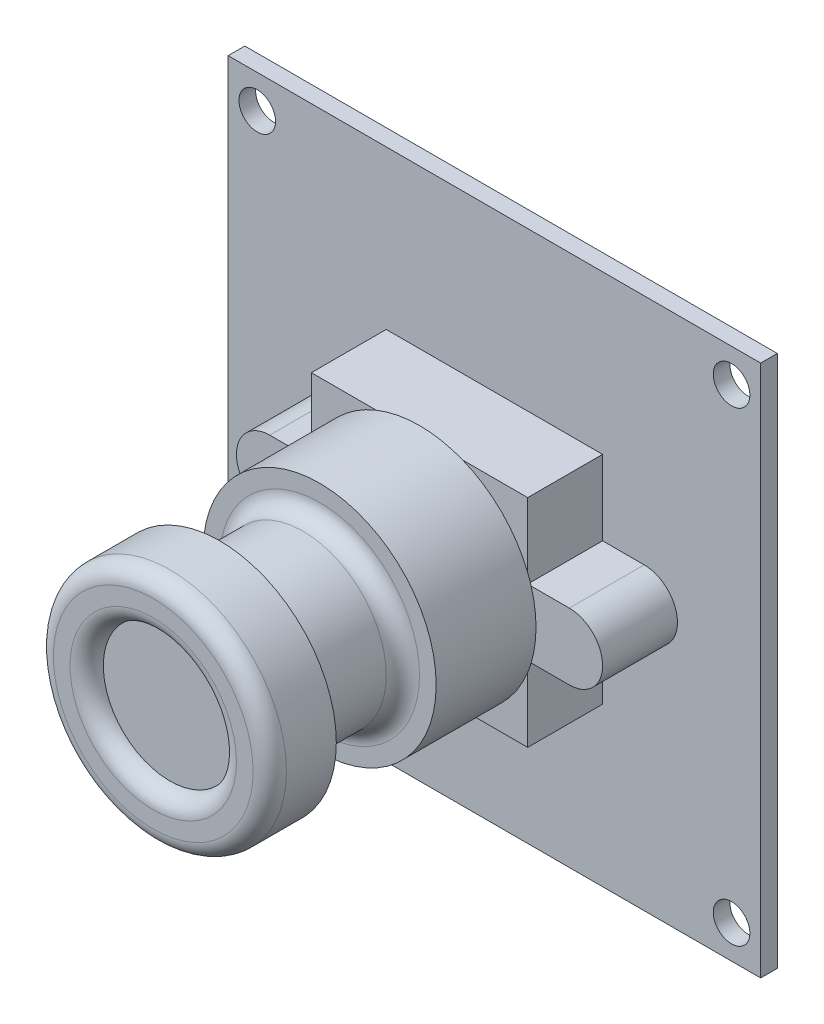
ISO-10303-21;
HEADER;
FILE_DESCRIPTION(('STEP AP214'),'2;1');
FILE_NAME('part.step','',(''),(''),'','','');
FILE_SCHEMA(('AUTOMOTIVE_DESIGN { 1 0 10303 214 1 1 1 1 }'));
ENDSEC;
DATA;
#1=APPLICATION_CONTEXT('core data for automotive mechanical design processes');
#2=APPLICATION_PROTOCOL_DEFINITION('international standard','automotive_design',2000,#1);
#3=PRODUCT_CONTEXT('',#1,'mechanical');
#4=PRODUCT('Part','Part','',(#3));
#5=PRODUCT_RELATED_PRODUCT_CATEGORY('part','',(#4));
#6=PRODUCT_DEFINITION_FORMATION('','',#4);
#7=PRODUCT_DEFINITION_CONTEXT('part definition',#1,'design');
#8=PRODUCT_DEFINITION('design','',#6,#7);
#9=PRODUCT_DEFINITION_SHAPE('','',#8);
#10=(LENGTH_UNIT() NAMED_UNIT(*) SI_UNIT(.MILLI.,.METRE.));
#11=(NAMED_UNIT(*) PLANE_ANGLE_UNIT() SI_UNIT($,.RADIAN.));
#12=(NAMED_UNIT(*) SI_UNIT($,.STERADIAN.) SOLID_ANGLE_UNIT());
#13=UNCERTAINTY_MEASURE_WITH_UNIT(LENGTH_MEASURE(1.E-05),#10,'distance_accuracy_value','');
#14=(GEOMETRIC_REPRESENTATION_CONTEXT(3) GLOBAL_UNCERTAINTY_ASSIGNED_CONTEXT((#13)) GLOBAL_UNIT_ASSIGNED_CONTEXT((#10,
#11,#12)) REPRESENTATION_CONTEXT('',''));
#15=CARTESIAN_POINT('',(0.,0.,0.));
#16=DIRECTION('',(0.,0.,1.));
#17=DIRECTION('',(1.,0.,0.));
#18=AXIS2_PLACEMENT_3D('',#15,#16,#17);
#19=CARTESIAN_POINT('',(-9.,0.,5.5));
#20=DIRECTION('',(0.,0.,1.));
#21=DIRECTION('',(1.,0.,0.));
#22=AXIS2_PLACEMENT_3D('',#19,#20,#21);
#23=PLANE('',#22);
#24=CARTESIAN_POINT('',(0.,0.,5.5));
#25=DIRECTION('',(0.,0.,1.));
#26=DIRECTION('',(1.,0.,0.));
#27=AXIS2_PLACEMENT_3D('',#24,#25,#26);
#28=CIRCLE('',#27,7.);
#29=CARTESIAN_POINT('',(6.5,2.59807621135332,5.5));
#30=VERTEX_POINT('',#29);
#31=CARTESIAN_POINT('',(2.59807621135332,6.5,5.5));
#32=VERTEX_POINT('',#31);
#33=EDGE_CURVE('E224',#30,#32,#28,.T.);
#34=ORIENTED_EDGE('',*,*,#33,.F.);
#35=DIRECTION('',(0.,1.,0.));
#36=VECTOR('',#35,1.);
#37=CARTESIAN_POINT('',(6.5,2.00000000000001,5.5));
#38=LINE('',#37,#36);
#39=CARTESIAN_POINT('',(6.5,6.5,5.5));
#40=VERTEX_POINT('',#39);
#41=EDGE_CURVE('E418',#30,#40,#38,.T.);
#42=ORIENTED_EDGE('',*,*,#41,.T.);
#43=DIRECTION('',(-1.,0.,0.));
#44=VECTOR('',#43,1.);
#45=CARTESIAN_POINT('',(-6.5,6.5,5.5));
#46=LINE('',#45,#44);
#47=EDGE_CURVE('E528',#40,#32,#46,.T.);
#48=ORIENTED_EDGE('',*,*,#47,.T.);
#49=EDGE_LOOP('',(#34,#42,#48));
#50=FACE_BOUND('',#49,.T.);
#51=ADVANCED_FACE('F36',(#50),#23,.T.);
#52=CARTESIAN_POINT('',(-2.59807621135332,6.5,5.5));
#53=VERTEX_POINT('',#52);
#54=CARTESIAN_POINT('',(-6.5,2.59807621135332,5.5));
#55=VERTEX_POINT('',#54);
#56=EDGE_CURVE('E310',#53,#55,#28,.T.);
#57=ORIENTED_EDGE('',*,*,#56,.F.);
#58=CARTESIAN_POINT('',(-6.5,6.5,5.5));
#59=VERTEX_POINT('',#58);
#60=EDGE_CURVE('E525',#53,#59,#46,.T.);
#61=ORIENTED_EDGE('',*,*,#60,.T.);
#62=DIRECTION('',(0.,-1.,0.));
#63=VECTOR('',#62,1.);
#64=CARTESIAN_POINT('',(-6.5,2.00000000000001,5.5));
#65=LINE('',#64,#63);
#66=EDGE_CURVE('E532',#59,#55,#65,.T.);
#67=ORIENTED_EDGE('',*,*,#66,.T.);
#68=EDGE_LOOP('',(#57,#61,#67));
#69=FACE_BOUND('',#68,.T.);
#70=ADVANCED_FACE('F251',(#69),#23,.T.);
#71=CARTESIAN_POINT('',(-6.70820393249937,2.00000000000001,5.5));
#72=VERTEX_POINT('',#71);
#73=CARTESIAN_POINT('',(-6.70820393249937,-2.,5.5));
#74=VERTEX_POINT('',#73);
#75=EDGE_CURVE('E309',#72,#74,#28,.T.);
#76=ORIENTED_EDGE('',*,*,#75,.F.);
#77=DIRECTION('',(-1.,0.,0.));
#78=VECTOR('',#77,1.);
#79=CARTESIAN_POINT('',(-9.,2.00000000000001,5.5));
#80=LINE('',#79,#78);
#81=CARTESIAN_POINT('',(-9.,2.00000000000001,5.5));
#82=VERTEX_POINT('',#81);
#83=EDGE_CURVE('E535',#72,#82,#80,.T.);
#84=ORIENTED_EDGE('',*,*,#83,.T.);
#85=CARTESIAN_POINT('',(-9.,0.,5.5));
#86=DIRECTION('',(0.,0.,1.));
#87=DIRECTION('',(1.,0.,0.));
#88=AXIS2_PLACEMENT_3D('',#85,#86,#87);
#89=CIRCLE('',#88,2.);
#90=CARTESIAN_POINT('',(-9.,-2.,5.5));
#91=VERTEX_POINT('',#90);
#92=EDGE_CURVE('E539',#82,#91,#89,.T.);
#93=ORIENTED_EDGE('',*,*,#92,.T.);
#94=DIRECTION('',(1.,0.,0.));
#95=VECTOR('',#94,1.);
#96=CARTESIAN_POINT('',(-9.,-2.,5.5));
#97=LINE('',#96,#95);
#98=EDGE_CURVE('E542',#91,#74,#97,.T.);
#99=ORIENTED_EDGE('',*,*,#98,.T.);
#100=EDGE_LOOP('',(#76,#84,#93,#99));
#101=FACE_BOUND('',#100,.T.);
#102=ADVANCED_FACE('F257',(#101),#23,.T.);
#103=CARTESIAN_POINT('',(-6.5,-2.59807621135332,5.5));
#104=VERTEX_POINT('',#103);
#105=CARTESIAN_POINT('',(-2.59807621135332,-6.5,5.5));
#106=VERTEX_POINT('',#105);
#107=EDGE_CURVE('E288',#104,#106,#28,.T.);
#108=ORIENTED_EDGE('',*,*,#107,.F.);
#109=DIRECTION('',(0.,-1.,0.));
#110=VECTOR('',#109,1.);
#111=CARTESIAN_POINT('',(-6.5,-6.5,5.5));
#112=LINE('',#111,#110);
#113=CARTESIAN_POINT('',(-6.5,-6.5,5.5));
#114=VERTEX_POINT('',#113);
#115=EDGE_CURVE('E545',#104,#114,#112,.T.);
#116=ORIENTED_EDGE('',*,*,#115,.T.);
#117=DIRECTION('',(1.,0.,0.));
#118=VECTOR('',#117,1.);
#119=CARTESIAN_POINT('',(-6.5,-6.5,5.5));
#120=LINE('',#119,#118);
#121=EDGE_CURVE('E300',#114,#106,#120,.T.);
#122=ORIENTED_EDGE('',*,*,#121,.T.);
#123=EDGE_LOOP('',(#108,#116,#122));
#124=FACE_BOUND('',#123,.T.);
#125=ADVANCED_FACE('F274',(#124),#23,.T.);
#126=CARTESIAN_POINT('',(2.59807621135332,-6.5,5.5));
#127=VERTEX_POINT('',#126);
#128=CARTESIAN_POINT('',(6.5,-2.59807621135332,5.5));
#129=VERTEX_POINT('',#128);
#130=EDGE_CURVE('E212',#127,#129,#28,.T.);
#131=ORIENTED_EDGE('',*,*,#130,.F.);
#132=CARTESIAN_POINT('',(6.5,-6.5,5.5));
#133=VERTEX_POINT('',#132);
#134=EDGE_CURVE('E285',#127,#133,#120,.T.);
#135=ORIENTED_EDGE('',*,*,#134,.T.);
#136=DIRECTION('',(0.,1.,0.));
#137=VECTOR('',#136,1.);
#138=CARTESIAN_POINT('',(6.5,-6.5,5.5));
#139=LINE('',#138,#137);
#140=EDGE_CURVE('E287',#133,#129,#139,.T.);
#141=ORIENTED_EDGE('',*,*,#140,.T.);
#142=EDGE_LOOP('',(#131,#135,#141));
#143=FACE_BOUND('',#142,.T.);
#144=ADVANCED_FACE('F263',(#143),#23,.T.);
#145=CARTESIAN_POINT('',(0.,0.,1.));
#146=DIRECTION('',(0.,0.,-1.));
#147=DIRECTION('',(-1.,0.,0.));
#148=AXIS2_PLACEMENT_3D('',#145,#146,#147);
#149=PLANE('',#148);
#150=CARTESIAN_POINT('',(14.25,-14.,1.));
#151=DIRECTION('',(0.,0.,1.));
#152=DIRECTION('',(-1.,0.,0.));
#153=AXIS2_PLACEMENT_3D('',#150,#151,#152);
#154=CIRCLE('',#153,1.1);
#155=CARTESIAN_POINT('',(13.15,-14.,1.));
#156=VERTEX_POINT('',#155);
#157=EDGE_CURVE('E450',#156,#156,#154,.T.);
#158=ORIENTED_EDGE('',*,*,#157,.F.);
#159=EDGE_LOOP('',(#158));
#160=FACE_BOUND('',#159,.T.);
#161=CARTESIAN_POINT('',(14.25,14.,1.));
#162=DIRECTION('',(0.,0.,1.));
#163=DIRECTION('',(-1.,0.,0.));
#164=AXIS2_PLACEMENT_3D('',#161,#162,#163);
#165=CIRCLE('',#164,1.1);
#166=CARTESIAN_POINT('',(13.15,14.,1.));
#167=VERTEX_POINT('',#166);
#168=EDGE_CURVE('E456',#167,#167,#165,.T.);
#169=ORIENTED_EDGE('',*,*,#168,.F.);
#170=EDGE_LOOP('',(#169));
#171=FACE_BOUND('',#170,.T.);
#172=CARTESIAN_POINT('',(-14.25,14.,1.));
#173=DIRECTION('',(0.,0.,1.));
#174=DIRECTION('',(1.,0.,0.));
#175=AXIS2_PLACEMENT_3D('',#172,#173,#174);
#176=CIRCLE('',#175,1.1);
#177=CARTESIAN_POINT('',(-13.15,14.,1.));
#178=VERTEX_POINT('',#177);
#179=EDGE_CURVE('E462',#178,#178,#176,.T.);
#180=ORIENTED_EDGE('',*,*,#179,.F.);
#181=EDGE_LOOP('',(#180));
#182=FACE_BOUND('',#181,.T.);
#183=CARTESIAN_POINT('',(-14.25,-14.,1.));
#184=DIRECTION('',(0.,0.,1.));
#185=DIRECTION('',(1.,0.,0.));
#186=AXIS2_PLACEMENT_3D('',#183,#184,#185);
#187=CIRCLE('',#186,1.1);
#188=CARTESIAN_POINT('',(-13.15,-14.,1.));
#189=VERTEX_POINT('',#188);
#190=EDGE_CURVE('E468',#189,#189,#187,.T.);
#191=ORIENTED_EDGE('',*,*,#190,.F.);
#192=EDGE_LOOP('',(#191));
#193=FACE_BOUND('',#192,.T.);
#194=DIRECTION('',(0.,1.,0.));
#195=VECTOR('',#194,1.);
#196=CARTESIAN_POINT('',(16.,-16.,1.));
#197=LINE('',#196,#195);
#198=CARTESIAN_POINT('',(16.,-16.,1.));
#199=VERTEX_POINT('',#198);
#200=CARTESIAN_POINT('',(16.,16.,1.));
#201=VERTEX_POINT('',#200);
#202=EDGE_CURVE('E474',#199,#201,#197,.T.);
#203=ORIENTED_EDGE('',*,*,#202,.T.);
#204=DIRECTION('',(-1.,0.,0.));
#205=VECTOR('',#204,1.);
#206=CARTESIAN_POINT('',(-16.,16.,1.));
#207=LINE('',#206,#205);
#208=CARTESIAN_POINT('',(-16.,16.,1.));
#209=VERTEX_POINT('',#208);
#210=EDGE_CURVE('E477',#201,#209,#207,.T.);
#211=ORIENTED_EDGE('',*,*,#210,.T.);
#212=DIRECTION('',(0.,-1.,0.));
#213=VECTOR('',#212,1.);
#214=CARTESIAN_POINT('',(-16.,-16.,1.));
#215=LINE('',#214,#213);
#216=CARTESIAN_POINT('',(-16.,-16.,1.));
#217=VERTEX_POINT('',#216);
#218=EDGE_CURVE('E480',#209,#217,#215,.T.);
#219=ORIENTED_EDGE('',*,*,#218,.T.);
#220=DIRECTION('',(1.,0.,0.));
#221=VECTOR('',#220,1.);
#222=CARTESIAN_POINT('',(-16.,-16.,1.));
#223=LINE('',#222,#221);
#224=EDGE_CURVE('E482',#217,#199,#223,.T.);
#225=ORIENTED_EDGE('',*,*,#224,.T.);
#226=EDGE_LOOP('',(#203,#211,#219,#225));
#227=FACE_BOUND('',#226,.T.);
#228=DIRECTION('',(0.,1.,0.));
#229=VECTOR('',#228,1.);
#230=CARTESIAN_POINT('',(6.5,2.00000000000001,1.));
#231=LINE('',#230,#229);
#232=CARTESIAN_POINT('',(6.5,2.00000000000001,1.));
#233=VERTEX_POINT('',#232);
#234=CARTESIAN_POINT('',(6.5,6.5,1.));
#235=VERTEX_POINT('',#234);
#236=EDGE_CURVE('E220',#233,#235,#231,.T.);
#237=ORIENTED_EDGE('',*,*,#236,.F.);
#238=DIRECTION('',(-1.,0.,0.));
#239=VECTOR('',#238,1.);
#240=CARTESIAN_POINT('',(9.,2.00000000000001,1.));
#241=LINE('',#240,#239);
#242=CARTESIAN_POINT('',(9.,2.,1.));
#243=VERTEX_POINT('',#242);
#244=EDGE_CURVE('E416',#243,#233,#241,.T.);
#245=ORIENTED_EDGE('',*,*,#244,.F.);
#246=CARTESIAN_POINT('',(9.,0.,1.));
#247=DIRECTION('',(0.,0.,1.));
#248=DIRECTION('',(-1.,0.,0.));
#249=AXIS2_PLACEMENT_3D('',#246,#247,#248);
#250=CIRCLE('',#249,2.);
#251=CARTESIAN_POINT('',(9.,-2.,1.));
#252=VERTEX_POINT('',#251);
#253=EDGE_CURVE('E413',#252,#243,#250,.T.);
#254=ORIENTED_EDGE('',*,*,#253,.F.);
#255=DIRECTION('',(1.,0.,0.));
#256=VECTOR('',#255,1.);
#257=CARTESIAN_POINT('',(9.,-2.,1.));
#258=LINE('',#257,#256);
#259=CARTESIAN_POINT('',(6.5,-2.,1.));
#260=VERTEX_POINT('',#259);
#261=EDGE_CURVE('E410',#260,#252,#258,.T.);
#262=ORIENTED_EDGE('',*,*,#261,.F.);
#263=DIRECTION('',(0.,1.,0.));
#264=VECTOR('',#263,1.);
#265=CARTESIAN_POINT('',(6.5,-6.5,1.));
#266=LINE('',#265,#264);
#267=CARTESIAN_POINT('',(6.5,-6.5,1.));
#268=VERTEX_POINT('',#267);
#269=EDGE_CURVE('E407',#268,#260,#266,.T.);
#270=ORIENTED_EDGE('',*,*,#269,.F.);
#271=DIRECTION('',(1.,0.,0.));
#272=VECTOR('',#271,1.);
#273=CARTESIAN_POINT('',(-6.5,-6.5,1.));
#274=LINE('',#273,#272);
#275=CARTESIAN_POINT('',(-6.5,-6.5,1.));
#276=VERTEX_POINT('',#275);
#277=EDGE_CURVE('E405',#276,#268,#274,.T.);
#278=ORIENTED_EDGE('',*,*,#277,.F.);
#279=DIRECTION('',(0.,-1.,0.));
#280=VECTOR('',#279,1.);
#281=CARTESIAN_POINT('',(-6.5,-6.5,1.));
#282=LINE('',#281,#280);
#283=CARTESIAN_POINT('',(-6.5,-2.,1.));
#284=VERTEX_POINT('',#283);
#285=EDGE_CURVE('E402',#284,#276,#282,.T.);
#286=ORIENTED_EDGE('',*,*,#285,.F.);
#287=DIRECTION('',(1.,0.,0.));
#288=VECTOR('',#287,1.);
#289=CARTESIAN_POINT('',(-9.,-2.,1.));
#290=LINE('',#289,#288);
#291=CARTESIAN_POINT('',(-9.,-2.,1.));
#292=VERTEX_POINT('',#291);
#293=EDGE_CURVE('E399',#292,#284,#290,.T.);
#294=ORIENTED_EDGE('',*,*,#293,.F.);
#295=CARTESIAN_POINT('',(-9.,0.,1.));
#296=DIRECTION('',(0.,0.,1.));
#297=DIRECTION('',(1.,0.,0.));
#298=AXIS2_PLACEMENT_3D('',#295,#296,#297);
#299=CIRCLE('',#298,2.);
#300=CARTESIAN_POINT('',(-9.,2.00000000000001,1.));
#301=VERTEX_POINT('',#300);
#302=EDGE_CURVE('E396',#301,#292,#299,.T.);
#303=ORIENTED_EDGE('',*,*,#302,.F.);
#304=DIRECTION('',(-1.,0.,0.));
#305=VECTOR('',#304,1.);
#306=CARTESIAN_POINT('',(-9.,2.00000000000001,1.));
#307=LINE('',#306,#305);
#308=CARTESIAN_POINT('',(-6.5,2.00000000000001,1.));
#309=VERTEX_POINT('',#308);
#310=EDGE_CURVE('E393',#309,#301,#307,.T.);
#311=ORIENTED_EDGE('',*,*,#310,.F.);
#312=DIRECTION('',(0.,-1.,0.));
#313=VECTOR('',#312,1.);
#314=CARTESIAN_POINT('',(-6.5,2.00000000000001,1.));
#315=LINE('',#314,#313);
#316=CARTESIAN_POINT('',(-6.5,6.5,1.));
#317=VERTEX_POINT('',#316);
#318=EDGE_CURVE('E390',#317,#309,#315,.T.);
#319=ORIENTED_EDGE('',*,*,#318,.F.);
#320=DIRECTION('',(-1.,0.,0.));
#321=VECTOR('',#320,1.);
#322=CARTESIAN_POINT('',(-6.5,6.5,1.));
#323=LINE('',#322,#321);
#324=EDGE_CURVE('E387',#235,#317,#323,.T.);
#325=ORIENTED_EDGE('',*,*,#324,.F.);
#326=EDGE_LOOP('',(#237,#245,#254,#262,#270,#278,#286,#294,#303,#311,#319,#325));
#327=FACE_BOUND('',#326,.T.);
#328=ADVANCED_FACE('F273',(#160,#171,#182,#193,#227,#327),#149,.F.);
#329=CARTESIAN_POINT('',(0.,0.,0.));
#330=DIRECTION('',(0.,0.,-1.));
#331=DIRECTION('',(-1.,0.,0.));
#332=AXIS2_PLACEMENT_3D('',#329,#330,#331);
#333=PLANE('',#332);
#334=CARTESIAN_POINT('',(14.25,14.,0.));
#335=DIRECTION('',(0.,0.,1.));
#336=DIRECTION('',(-1.,0.,0.));
#337=AXIS2_PLACEMENT_3D('',#334,#335,#336);
#338=CIRCLE('',#337,1.1);
#339=CARTESIAN_POINT('',(13.15,14.,0.));
#340=VERTEX_POINT('',#339);
#341=EDGE_CURVE('E453',#340,#340,#338,.T.);
#342=ORIENTED_EDGE('',*,*,#341,.T.);
#343=EDGE_LOOP('',(#342));
#344=FACE_BOUND('',#343,.T.);
#345=CARTESIAN_POINT('',(-14.25,-14.,0.));
#346=DIRECTION('',(0.,0.,1.));
#347=DIRECTION('',(1.,0.,0.));
#348=AXIS2_PLACEMENT_3D('',#345,#346,#347);
#349=CIRCLE('',#348,1.1);
#350=CARTESIAN_POINT('',(-13.15,-14.,0.));
#351=VERTEX_POINT('',#350);
#352=EDGE_CURVE('E465',#351,#351,#349,.T.);
#353=ORIENTED_EDGE('',*,*,#352,.T.);
#354=EDGE_LOOP('',(#353));
#355=FACE_BOUND('',#354,.T.);
#356=DIRECTION('',(0.,1.,0.));
#357=VECTOR('',#356,1.);
#358=CARTESIAN_POINT('',(16.,-16.,0.));
#359=LINE('',#358,#357);
#360=CARTESIAN_POINT('',(16.,-16.,0.));
#361=VERTEX_POINT('',#360);
#362=CARTESIAN_POINT('',(16.,16.,0.));
#363=VERTEX_POINT('',#362);
#364=EDGE_CURVE('E471',#361,#363,#359,.T.);
#365=ORIENTED_EDGE('',*,*,#364,.F.);
#366=DIRECTION('',(1.,0.,0.));
#367=VECTOR('',#366,1.);
#368=CARTESIAN_POINT('',(-16.,-16.,0.));
#369=LINE('',#368,#367);
#370=CARTESIAN_POINT('',(-16.,-16.,0.));
#371=VERTEX_POINT('',#370);
#372=EDGE_CURVE('E478',#371,#361,#369,.T.);
#373=ORIENTED_EDGE('',*,*,#372,.F.);
#374=DIRECTION('',(0.,-1.,0.));
#375=VECTOR('',#374,1.);
#376=CARTESIAN_POINT('',(-16.,-16.,0.));
#377=LINE('',#376,#375);
#378=CARTESIAN_POINT('',(-16.,16.,0.));
#379=VERTEX_POINT('',#378);
#380=EDGE_CURVE('E489',#379,#371,#377,.T.);
#381=ORIENTED_EDGE('',*,*,#380,.F.);
#382=DIRECTION('',(-1.,0.,0.));
#383=VECTOR('',#382,1.);
#384=CARTESIAN_POINT('',(-16.,16.,0.));
#385=LINE('',#384,#383);
#386=EDGE_CURVE('E487',#363,#379,#385,.T.);
#387=ORIENTED_EDGE('',*,*,#386,.F.);
#388=EDGE_LOOP('',(#365,#373,#381,#387));
#389=FACE_BOUND('',#388,.T.);
#390=CARTESIAN_POINT('',(-14.25,14.,0.));
#391=DIRECTION('',(0.,0.,1.));
#392=DIRECTION('',(1.,0.,0.));
#393=AXIS2_PLACEMENT_3D('',#390,#391,#392);
#394=CIRCLE('',#393,1.1);
#395=CARTESIAN_POINT('',(-13.15,14.,0.));
#396=VERTEX_POINT('',#395);
#397=EDGE_CURVE('E459',#396,#396,#394,.T.);
#398=ORIENTED_EDGE('',*,*,#397,.T.);
#399=EDGE_LOOP('',(#398));
#400=FACE_BOUND('',#399,.T.);
#401=CARTESIAN_POINT('',(14.25,-14.,0.));
#402=DIRECTION('',(0.,0.,1.));
#403=DIRECTION('',(-1.,0.,0.));
#404=AXIS2_PLACEMENT_3D('',#401,#402,#403);
#405=CIRCLE('',#404,1.1);
#406=CARTESIAN_POINT('',(13.15,-14.,0.));
#407=VERTEX_POINT('',#406);
#408=EDGE_CURVE('E449',#407,#407,#405,.T.);
#409=ORIENTED_EDGE('',*,*,#408,.T.);
#410=EDGE_LOOP('',(#409));
#411=FACE_BOUND('',#410,.T.);
#412=ADVANCED_FACE('F280',(#344,#355,#389,#400,#411),#333,.T.);
#413=CARTESIAN_POINT('',(16.,-16.,1.));
#414=DIRECTION('',(-1.,0.,0.));
#415=DIRECTION('',(0.,0.,1.));
#416=AXIS2_PLACEMENT_3D('',#413,#414,#415);
#417=PLANE('',#416);
#418=ORIENTED_EDGE('',*,*,#364,.T.);
#419=DIRECTION('',(0.,0.,-1.));
#420=VECTOR('',#419,1.);
#421=CARTESIAN_POINT('',(16.,16.,1.));
#422=LINE('',#421,#420);
#423=EDGE_CURVE('E213',#201,#363,#422,.T.);
#424=ORIENTED_EDGE('',*,*,#423,.F.);
#425=ORIENTED_EDGE('',*,*,#202,.F.);
#426=DIRECTION('',(0.,0.,-1.));
#427=VECTOR('',#426,1.);
#428=CARTESIAN_POINT('',(16.,-16.,1.));
#429=LINE('',#428,#427);
#430=EDGE_CURVE('E484',#199,#361,#429,.T.);
#431=ORIENTED_EDGE('',*,*,#430,.T.);
#432=EDGE_LOOP('',(#418,#424,#425,#431));
#433=FACE_BOUND('',#432,.T.);
#434=ADVANCED_FACE('F509',(#433),#417,.F.);
#435=CARTESIAN_POINT('',(-16.,16.,1.));
#436=DIRECTION('',(0.,-1.,0.));
#437=DIRECTION('',(0.,0.,-1.));
#438=AXIS2_PLACEMENT_3D('',#435,#436,#437);
#439=PLANE('',#438);
#440=ORIENTED_EDGE('',*,*,#386,.T.);
#441=DIRECTION('',(0.,0.,-1.));
#442=VECTOR('',#441,1.);
#443=CARTESIAN_POINT('',(-16.,16.,1.));
#444=LINE('',#443,#442);
#445=EDGE_CURVE('E496',#209,#379,#444,.T.);
#446=ORIENTED_EDGE('',*,*,#445,.F.);
#447=ORIENTED_EDGE('',*,*,#210,.F.);
#448=ORIENTED_EDGE('',*,*,#423,.T.);
#449=EDGE_LOOP('',(#440,#446,#447,#448));
#450=FACE_BOUND('',#449,.T.);
#451=ADVANCED_FACE('F505',(#450),#439,.F.);
#452=CARTESIAN_POINT('',(-16.,-16.,1.));
#453=DIRECTION('',(1.,0.,0.));
#454=DIRECTION('',(0.,0.,-1.));
#455=AXIS2_PLACEMENT_3D('',#452,#453,#454);
#456=PLANE('',#455);
#457=ORIENTED_EDGE('',*,*,#380,.T.);
#458=DIRECTION('',(0.,0.,-1.));
#459=VECTOR('',#458,1.);
#460=CARTESIAN_POINT('',(-16.,-16.,1.));
#461=LINE('',#460,#459);
#462=EDGE_CURVE('E494',#217,#371,#461,.T.);
#463=ORIENTED_EDGE('',*,*,#462,.F.);
#464=ORIENTED_EDGE('',*,*,#218,.F.);
#465=ORIENTED_EDGE('',*,*,#445,.T.);
#466=EDGE_LOOP('',(#457,#463,#464,#465));
#467=FACE_BOUND('',#466,.T.);
#468=ADVANCED_FACE('F515',(#467),#456,.F.);
#469=CARTESIAN_POINT('',(-16.,-16.,1.));
#470=DIRECTION('',(0.,1.,0.));
#471=DIRECTION('',(0.,0.,1.));
#472=AXIS2_PLACEMENT_3D('',#469,#470,#471);
#473=PLANE('',#472);
#474=ORIENTED_EDGE('',*,*,#372,.T.);
#475=ORIENTED_EDGE('',*,*,#430,.F.);
#476=ORIENTED_EDGE('',*,*,#224,.F.);
#477=ORIENTED_EDGE('',*,*,#462,.T.);
#478=EDGE_LOOP('',(#474,#475,#476,#477));
#479=FACE_BOUND('',#478,.T.);
#480=ADVANCED_FACE('F518',(#479),#473,.F.);
#481=CARTESIAN_POINT('',(-14.25,-14.,1.));
#482=DIRECTION('',(0.,0.,-1.));
#483=DIRECTION('',(-1.,0.,0.));
#484=AXIS2_PLACEMENT_3D('',#481,#482,#483);
#485=CYLINDRICAL_SURFACE('',#484,1.1);
#486=ORIENTED_EDGE('',*,*,#190,.T.);
#487=EDGE_LOOP('',(#486));
#488=FACE_BOUND('',#487,.T.);
#489=ORIENTED_EDGE('',*,*,#352,.F.);
#490=EDGE_LOOP('',(#489));
#491=FACE_BOUND('',#490,.T.);
#492=ADVANCED_FACE('F899',(#488,#491),#485,.F.);
#493=CARTESIAN_POINT('',(-14.25,14.,1.));
#494=DIRECTION('',(0.,0.,-1.));
#495=DIRECTION('',(-1.,0.,0.));
#496=AXIS2_PLACEMENT_3D('',#493,#494,#495);
#497=CYLINDRICAL_SURFACE('',#496,1.1);
#498=ORIENTED_EDGE('',*,*,#179,.T.);
#499=EDGE_LOOP('',(#498));
#500=FACE_BOUND('',#499,.T.);
#501=ORIENTED_EDGE('',*,*,#397,.F.);
#502=EDGE_LOOP('',(#501));
#503=FACE_BOUND('',#502,.T.);
#504=ADVANCED_FACE('F888',(#500,#503),#497,.F.);
#505=CARTESIAN_POINT('',(14.25,14.,1.));
#506=DIRECTION('',(0.,0.,-1.));
#507=DIRECTION('',(-1.,0.,0.));
#508=AXIS2_PLACEMENT_3D('',#505,#506,#507);
#509=CYLINDRICAL_SURFACE('',#508,1.1);
#510=ORIENTED_EDGE('',*,*,#168,.T.);
#511=EDGE_LOOP('',(#510));
#512=FACE_BOUND('',#511,.T.);
#513=ORIENTED_EDGE('',*,*,#341,.F.);
#514=EDGE_LOOP('',(#513));
#515=FACE_BOUND('',#514,.T.);
#516=ADVANCED_FACE('F878',(#512,#515),#509,.F.);
#517=CARTESIAN_POINT('',(14.25,-14.,1.));
#518=DIRECTION('',(0.,0.,-1.));
#519=DIRECTION('',(-1.,0.,0.));
#520=AXIS2_PLACEMENT_3D('',#517,#518,#519);
#521=CYLINDRICAL_SURFACE('',#520,1.1);
#522=ORIENTED_EDGE('',*,*,#157,.T.);
#523=EDGE_LOOP('',(#522));
#524=FACE_BOUND('',#523,.T.);
#525=ORIENTED_EDGE('',*,*,#408,.F.);
#526=EDGE_LOOP('',(#525));
#527=FACE_BOUND('',#526,.T.);
#528=ADVANCED_FACE('F610',(#524,#527),#521,.F.);
#529=CARTESIAN_POINT('',(6.5,2.00000000000001,5.5));
#530=DIRECTION('',(-1.,0.,0.));
#531=DIRECTION('',(0.,0.,1.));
#532=AXIS2_PLACEMENT_3D('',#529,#530,#531);
#533=PLANE('',#532);
#534=ORIENTED_EDGE('',*,*,#236,.T.);
#535=DIRECTION('',(0.,0.,-1.));
#536=VECTOR('',#535,1.);
#537=CARTESIAN_POINT('',(6.5,6.5,5.5));
#538=LINE('',#537,#536);
#539=EDGE_CURVE('E446',#40,#235,#538,.T.);
#540=ORIENTED_EDGE('',*,*,#539,.F.);
#541=ORIENTED_EDGE('',*,*,#41,.F.);
#542=CARTESIAN_POINT('',(6.5,2.00000000000001,5.5));
#543=VERTEX_POINT('',#542);
#544=EDGE_CURVE('E216',#543,#30,#38,.T.);
#545=ORIENTED_EDGE('',*,*,#544,.F.);
#546=DIRECTION('',(0.,0.,-1.));
#547=VECTOR('',#546,1.);
#548=CARTESIAN_POINT('',(6.5,2.00000000000001,5.5));
#549=LINE('',#548,#547);
#550=EDGE_CURVE('E192',#543,#233,#549,.T.);
#551=ORIENTED_EDGE('',*,*,#550,.T.);
#552=EDGE_LOOP('',(#534,#540,#541,#545,#551));
#553=FACE_BOUND('',#552,.T.);
#554=ADVANCED_FACE('F523',(#553),#533,.F.);
#555=CARTESIAN_POINT('',(-6.5,6.5,5.5));
#556=DIRECTION('',(0.,-1.,0.));
#557=DIRECTION('',(0.,0.,-1.));
#558=AXIS2_PLACEMENT_3D('',#555,#556,#557);
#559=PLANE('',#558);
#560=ORIENTED_EDGE('',*,*,#324,.T.);
#561=DIRECTION('',(0.,0.,-1.));
#562=VECTOR('',#561,1.);
#563=CARTESIAN_POINT('',(-6.5,6.5,5.5));
#564=LINE('',#563,#562);
#565=EDGE_CURVE('E443',#59,#317,#564,.T.);
#566=ORIENTED_EDGE('',*,*,#565,.F.);
#567=ORIENTED_EDGE('',*,*,#60,.F.);
#568=EDGE_CURVE('E526',#32,#53,#46,.T.);
#569=ORIENTED_EDGE('',*,*,#568,.F.);
#570=ORIENTED_EDGE('',*,*,#47,.F.);
#571=ORIENTED_EDGE('',*,*,#539,.T.);
#572=EDGE_LOOP('',(#560,#566,#567,#569,#570,#571));
#573=FACE_BOUND('',#572,.T.);
#574=ADVANCED_FACE('F569',(#573),#559,.F.);
#575=CARTESIAN_POINT('',(-6.5,2.00000000000001,5.5));
#576=DIRECTION('',(1.,0.,0.));
#577=DIRECTION('',(0.,0.,-1.));
#578=AXIS2_PLACEMENT_3D('',#575,#576,#577);
#579=PLANE('',#578);
#580=ORIENTED_EDGE('',*,*,#318,.T.);
#581=DIRECTION('',(0.,0.,-1.));
#582=VECTOR('',#581,1.);
#583=CARTESIAN_POINT('',(-6.5,2.00000000000001,5.5));
#584=LINE('',#583,#582);
#585=CARTESIAN_POINT('',(-6.5,2.00000000000001,5.5));
#586=VERTEX_POINT('',#585);
#587=EDGE_CURVE('E440',#586,#309,#584,.T.);
#588=ORIENTED_EDGE('',*,*,#587,.F.);
#589=EDGE_CURVE('E531',#55,#586,#65,.T.);
#590=ORIENTED_EDGE('',*,*,#589,.F.);
#591=ORIENTED_EDGE('',*,*,#66,.F.);
#592=ORIENTED_EDGE('',*,*,#565,.T.);
#593=EDGE_LOOP('',(#580,#588,#590,#591,#592));
#594=FACE_BOUND('',#593,.T.);
#595=ADVANCED_FACE('F565',(#594),#579,.F.);
#596=CARTESIAN_POINT('',(-9.,2.00000000000001,5.5));
#597=DIRECTION('',(0.,-1.,0.));
#598=DIRECTION('',(0.,0.,-1.));
#599=AXIS2_PLACEMENT_3D('',#596,#597,#598);
#600=PLANE('',#599);
#601=ORIENTED_EDGE('',*,*,#310,.T.);
#602=DIRECTION('',(0.,0.,-1.));
#603=VECTOR('',#602,1.);
#604=CARTESIAN_POINT('',(-9.,2.00000000000001,5.5));
#605=LINE('',#604,#603);
#606=EDGE_CURVE('E437',#82,#301,#605,.T.);
#607=ORIENTED_EDGE('',*,*,#606,.F.);
#608=ORIENTED_EDGE('',*,*,#83,.F.);
#609=EDGE_CURVE('E536',#586,#72,#80,.T.);
#610=ORIENTED_EDGE('',*,*,#609,.F.);
#611=ORIENTED_EDGE('',*,*,#587,.T.);
#612=EDGE_LOOP('',(#601,#607,#608,#610,#611));
#613=FACE_BOUND('',#612,.T.);
#614=ADVANCED_FACE('F560',(#613),#600,.F.);
#615=CARTESIAN_POINT('',(-9.,0.,5.5));
#616=DIRECTION('',(0.,0.,-1.));
#617=DIRECTION('',(-1.,0.,0.));
#618=AXIS2_PLACEMENT_3D('',#615,#616,#617);
#619=CYLINDRICAL_SURFACE('',#618,2.);
#620=ORIENTED_EDGE('',*,*,#302,.T.);
#621=DIRECTION('',(0.,0.,-1.));
#622=VECTOR('',#621,1.);
#623=CARTESIAN_POINT('',(-9.,-2.,5.5));
#624=LINE('',#623,#622);
#625=EDGE_CURVE('E434',#91,#292,#624,.T.);
#626=ORIENTED_EDGE('',*,*,#625,.F.);
#627=ORIENTED_EDGE('',*,*,#92,.F.);
#628=ORIENTED_EDGE('',*,*,#606,.T.);
#629=EDGE_LOOP('',(#620,#626,#627,#628));
#630=FACE_BOUND('',#629,.T.);
#631=ADVANCED_FACE('F557',(#630),#619,.T.);
#632=CARTESIAN_POINT('',(-9.,-2.,5.5));
#633=DIRECTION('',(0.,1.,0.));
#634=DIRECTION('',(0.,0.,1.));
#635=AXIS2_PLACEMENT_3D('',#632,#633,#634);
#636=PLANE('',#635);
#637=ORIENTED_EDGE('',*,*,#293,.T.);
#638=DIRECTION('',(0.,0.,-1.));
#639=VECTOR('',#638,1.);
#640=CARTESIAN_POINT('',(-6.5,-2.,5.5));
#641=LINE('',#640,#639);
#642=CARTESIAN_POINT('',(-6.5,-2.,5.5));
#643=VERTEX_POINT('',#642);
#644=EDGE_CURVE('E431',#643,#284,#641,.T.);
#645=ORIENTED_EDGE('',*,*,#644,.F.);
#646=EDGE_CURVE('E541',#74,#643,#97,.T.);
#647=ORIENTED_EDGE('',*,*,#646,.F.);
#648=ORIENTED_EDGE('',*,*,#98,.F.);
#649=ORIENTED_EDGE('',*,*,#625,.T.);
#650=EDGE_LOOP('',(#637,#645,#647,#648,#649));
#651=FACE_BOUND('',#650,.T.);
#652=ADVANCED_FACE('F552',(#651),#636,.F.);
#653=CARTESIAN_POINT('',(-6.5,-6.5,5.5));
#654=DIRECTION('',(1.,0.,0.));
#655=DIRECTION('',(0.,0.,-1.));
#656=AXIS2_PLACEMENT_3D('',#653,#654,#655);
#657=PLANE('',#656);
#658=ORIENTED_EDGE('',*,*,#285,.T.);
#659=DIRECTION('',(0.,0.,-1.));
#660=VECTOR('',#659,1.);
#661=CARTESIAN_POINT('',(-6.5,-6.5,5.5));
#662=LINE('',#661,#660);
#663=EDGE_CURVE('E428',#114,#276,#662,.T.);
#664=ORIENTED_EDGE('',*,*,#663,.F.);
#665=ORIENTED_EDGE('',*,*,#115,.F.);
#666=EDGE_CURVE('E298',#643,#104,#112,.T.);
#667=ORIENTED_EDGE('',*,*,#666,.F.);
#668=ORIENTED_EDGE('',*,*,#644,.T.);
#669=EDGE_LOOP('',(#658,#664,#665,#667,#668));
#670=FACE_BOUND('',#669,.T.);
#671=ADVANCED_FACE('F549',(#670),#657,.F.);
#672=CARTESIAN_POINT('',(-6.5,-6.5,5.5));
#673=DIRECTION('',(0.,1.,0.));
#674=DIRECTION('',(0.,0.,1.));
#675=AXIS2_PLACEMENT_3D('',#672,#673,#674);
#676=PLANE('',#675);
#677=ORIENTED_EDGE('',*,*,#277,.T.);
#678=DIRECTION('',(0.,0.,-1.));
#679=VECTOR('',#678,1.);
#680=CARTESIAN_POINT('',(6.5,-6.5,5.5));
#681=LINE('',#680,#679);
#682=EDGE_CURVE('E297',#133,#268,#681,.T.);
#683=ORIENTED_EDGE('',*,*,#682,.F.);
#684=ORIENTED_EDGE('',*,*,#134,.F.);
#685=EDGE_CURVE('E294',#106,#127,#120,.T.);
#686=ORIENTED_EDGE('',*,*,#685,.F.);
#687=ORIENTED_EDGE('',*,*,#121,.F.);
#688=ORIENTED_EDGE('',*,*,#663,.T.);
#689=EDGE_LOOP('',(#677,#683,#684,#686,#687,#688));
#690=FACE_BOUND('',#689,.T.);
#691=ADVANCED_FACE('F292',(#690),#676,.F.);
#692=CARTESIAN_POINT('',(6.5,-6.5,5.5));
#693=DIRECTION('',(-1.,0.,0.));
#694=DIRECTION('',(0.,0.,1.));
#695=AXIS2_PLACEMENT_3D('',#692,#693,#694);
#696=PLANE('',#695);
#697=ORIENTED_EDGE('',*,*,#269,.T.);
#698=DIRECTION('',(0.,0.,-1.));
#699=VECTOR('',#698,1.);
#700=CARTESIAN_POINT('',(6.5,-2.,5.5));
#701=LINE('',#700,#699);
#702=CARTESIAN_POINT('',(6.5,-2.,5.5));
#703=VERTEX_POINT('',#702);
#704=EDGE_CURVE('E425',#703,#260,#701,.T.);
#705=ORIENTED_EDGE('',*,*,#704,.F.);
#706=EDGE_CURVE('E59',#129,#703,#139,.T.);
#707=ORIENTED_EDGE('',*,*,#706,.F.);
#708=ORIENTED_EDGE('',*,*,#140,.F.);
#709=ORIENTED_EDGE('',*,*,#682,.T.);
#710=EDGE_LOOP('',(#697,#705,#707,#708,#709));
#711=FACE_BOUND('',#710,.T.);
#712=ADVANCED_FACE('F669',(#711),#696,.F.);
#713=CARTESIAN_POINT('',(9.,-2.,5.5));
#714=DIRECTION('',(0.,1.,0.));
#715=DIRECTION('',(0.,0.,1.));
#716=AXIS2_PLACEMENT_3D('',#713,#714,#715);
#717=PLANE('',#716);
#718=ORIENTED_EDGE('',*,*,#261,.T.);
#719=DIRECTION('',(0.,0.,-1.));
#720=VECTOR('',#719,1.);
#721=CARTESIAN_POINT('',(9.,-2.,5.5));
#722=LINE('',#721,#720);
#723=CARTESIAN_POINT('',(9.,-2.,5.5));
#724=VERTEX_POINT('',#723);
#725=EDGE_CURVE('E422',#724,#252,#722,.T.);
#726=ORIENTED_EDGE('',*,*,#725,.F.);
#727=DIRECTION('',(1.,0.,0.));
#728=VECTOR('',#727,1.);
#729=CARTESIAN_POINT('',(9.,-2.,5.5));
#730=LINE('',#729,#728);
#731=CARTESIAN_POINT('',(6.70820393249937,-2.,5.5));
#732=VERTEX_POINT('',#731);
#733=EDGE_CURVE('E380',#732,#724,#730,.T.);
#734=ORIENTED_EDGE('',*,*,#733,.F.);
#735=EDGE_CURVE('E377',#703,#732,#730,.T.);
#736=ORIENTED_EDGE('',*,*,#735,.F.);
#737=ORIENTED_EDGE('',*,*,#704,.T.);
#738=EDGE_LOOP('',(#718,#726,#734,#736,#737));
#739=FACE_BOUND('',#738,.T.);
#740=ADVANCED_FACE('F679',(#739),#717,.F.);
#741=CARTESIAN_POINT('',(9.,0.,5.5));
#742=DIRECTION('',(0.,0.,-1.));
#743=DIRECTION('',(-1.,0.,0.));
#744=AXIS2_PLACEMENT_3D('',#741,#742,#743);
#745=CYLINDRICAL_SURFACE('',#744,2.);
#746=ORIENTED_EDGE('',*,*,#253,.T.);
#747=DIRECTION('',(0.,0.,-1.));
#748=VECTOR('',#747,1.);
#749=CARTESIAN_POINT('',(9.,2.,5.5));
#750=LINE('',#749,#748);
#751=CARTESIAN_POINT('',(9.,2.,5.5));
#752=VERTEX_POINT('',#751);
#753=EDGE_CURVE('E420',#752,#243,#750,.T.);
#754=ORIENTED_EDGE('',*,*,#753,.F.);
#755=CARTESIAN_POINT('',(9.,0.,5.5));
#756=DIRECTION('',(0.,0.,1.));
#757=DIRECTION('',(-1.,0.,0.));
#758=AXIS2_PLACEMENT_3D('',#755,#756,#757);
#759=CIRCLE('',#758,2.);
#760=EDGE_CURVE('E188',#724,#752,#759,.T.);
#761=ORIENTED_EDGE('',*,*,#760,.F.);
#762=ORIENTED_EDGE('',*,*,#725,.T.);
#763=EDGE_LOOP('',(#746,#754,#761,#762));
#764=FACE_BOUND('',#763,.T.);
#765=ADVANCED_FACE('F271',(#764),#745,.T.);
#766=CARTESIAN_POINT('',(9.,2.00000000000001,5.5));
#767=DIRECTION('',(0.,-1.,0.));
#768=DIRECTION('',(0.,0.,-1.));
#769=AXIS2_PLACEMENT_3D('',#766,#767,#768);
#770=PLANE('',#769);
#771=ORIENTED_EDGE('',*,*,#244,.T.);
#772=ORIENTED_EDGE('',*,*,#550,.F.);
#773=DIRECTION('',(-1.,0.,0.));
#774=VECTOR('',#773,1.);
#775=CARTESIAN_POINT('',(9.,2.00000000000001,5.5));
#776=LINE('',#775,#774);
#777=CARTESIAN_POINT('',(6.70820393249937,2.00000000000001,5.5));
#778=VERTEX_POINT('',#777);
#779=EDGE_CURVE('E193',#778,#543,#776,.T.);
#780=ORIENTED_EDGE('',*,*,#779,.F.);
#781=EDGE_CURVE('E184',#752,#778,#776,.T.);
#782=ORIENTED_EDGE('',*,*,#781,.F.);
#783=ORIENTED_EDGE('',*,*,#753,.T.);
#784=EDGE_LOOP('',(#771,#772,#780,#782,#783));
#785=FACE_BOUND('',#784,.T.);
#786=ADVANCED_FACE('F197',(#785),#770,.F.);
#787=EDGE_CURVE('E51',#732,#778,#28,.T.);
#788=ORIENTED_EDGE('',*,*,#787,.F.);
#789=ORIENTED_EDGE('',*,*,#733,.T.);
#790=ORIENTED_EDGE('',*,*,#760,.T.);
#791=ORIENTED_EDGE('',*,*,#781,.T.);
#792=EDGE_LOOP('',(#788,#789,#790,#791));
#793=FACE_BOUND('',#792,.T.);
#794=ADVANCED_FACE('F186',(#793),#23,.T.);
#795=CARTESIAN_POINT('',(0.,0.,5.5));
#796=DIRECTION('',(0.,0.,1.));
#797=DIRECTION('',(1.,0.,0.));
#798=AXIS2_PLACEMENT_3D('',#795,#796,#797);
#799=PLANE('',#798);
#800=EDGE_CURVE('E218',#32,#53,#28,.T.);
#801=ORIENTED_EDGE('',*,*,#800,.F.);
#802=ORIENTED_EDGE('',*,*,#568,.T.);
#803=EDGE_LOOP('',(#801,#802));
#804=FACE_BOUND('',#803,.T.);
#805=ADVANCED_FACE('F262',(#804),#799,.F.);
#806=EDGE_CURVE('E223',#55,#72,#28,.T.);
#807=ORIENTED_EDGE('',*,*,#806,.F.);
#808=ORIENTED_EDGE('',*,*,#589,.T.);
#809=ORIENTED_EDGE('',*,*,#609,.T.);
#810=EDGE_LOOP('',(#807,#808,#809));
#811=FACE_BOUND('',#810,.T.);
#812=ADVANCED_FACE('F268',(#811),#799,.F.);
#813=EDGE_CURVE('E229',#74,#104,#28,.T.);
#814=ORIENTED_EDGE('',*,*,#813,.F.);
#815=ORIENTED_EDGE('',*,*,#646,.T.);
#816=ORIENTED_EDGE('',*,*,#666,.T.);
#817=EDGE_LOOP('',(#814,#815,#816));
#818=FACE_BOUND('',#817,.T.);
#819=ADVANCED_FACE('F374',(#818),#799,.F.);
#820=EDGE_CURVE('E226',#106,#127,#28,.T.);
#821=ORIENTED_EDGE('',*,*,#820,.F.);
#822=ORIENTED_EDGE('',*,*,#685,.T.);
#823=EDGE_LOOP('',(#821,#822));
#824=FACE_BOUND('',#823,.T.);
#825=ADVANCED_FACE('F303',(#824),#799,.F.);
#826=EDGE_CURVE('E211',#129,#732,#28,.T.);
#827=ORIENTED_EDGE('',*,*,#826,.F.);
#828=ORIENTED_EDGE('',*,*,#706,.T.);
#829=ORIENTED_EDGE('',*,*,#735,.T.);
#830=EDGE_LOOP('',(#827,#828,#829));
#831=FACE_BOUND('',#830,.T.);
#832=ADVANCED_FACE('F364',(#831),#799,.F.);
#833=ORIENTED_EDGE('',*,*,#779,.T.);
#834=ORIENTED_EDGE('',*,*,#544,.T.);
#835=EDGE_CURVE('E208',#778,#30,#28,.T.);
#836=ORIENTED_EDGE('',*,*,#835,.F.);
#837=EDGE_LOOP('',(#833,#834,#836));
#838=FACE_BOUND('',#837,.T.);
#839=ADVANCED_FACE('F215',(#838),#799,.F.);
#840=CARTESIAN_POINT('',(0.,0.,11.5));
#841=DIRECTION('',(0.,0.,-1.));
#842=DIRECTION('',(-1.,0.,0.));
#843=AXIS2_PLACEMENT_3D('',#840,#841,#842);
#844=CYLINDRICAL_SURFACE('',#843,7.);
#845=CARTESIAN_POINT('',(0.,0.,11.5));
#846=DIRECTION('',(0.,0.,1.));
#847=DIRECTION('',(1.,0.,0.));
#848=AXIS2_PLACEMENT_3D('',#845,#846,#847);
#849=CIRCLE('',#848,7.);
#850=CARTESIAN_POINT('',(7.,0.,11.5));
#851=VERTEX_POINT('',#850);
#852=EDGE_CURVE('E217',#851,#851,#849,.T.);
#853=ORIENTED_EDGE('',*,*,#852,.F.);
#854=EDGE_LOOP('',(#853));
#855=FACE_BOUND('',#854,.T.);
#856=ORIENTED_EDGE('',*,*,#835,.T.);
#857=ORIENTED_EDGE('',*,*,#33,.T.);
#858=ORIENTED_EDGE('',*,*,#800,.T.);
#859=ORIENTED_EDGE('',*,*,#56,.T.);
#860=ORIENTED_EDGE('',*,*,#806,.T.);
#861=ORIENTED_EDGE('',*,*,#75,.T.);
#862=ORIENTED_EDGE('',*,*,#813,.T.);
#863=ORIENTED_EDGE('',*,*,#107,.T.);
#864=ORIENTED_EDGE('',*,*,#820,.T.);
#865=ORIENTED_EDGE('',*,*,#130,.T.);
#866=ORIENTED_EDGE('',*,*,#826,.T.);
#867=ORIENTED_EDGE('',*,*,#787,.T.);
#868=EDGE_LOOP('',(#856,#857,#858,#859,#860,#861,#862,#863,#864,#865,#866,#867));
#869=FACE_BOUND('',#868,.T.);
#870=ADVANCED_FACE('F206',(#855,#869),#844,.T.);
#871=CARTESIAN_POINT('',(0.,0.,11.5));
#872=DIRECTION('',(0.,0.,1.));
#873=DIRECTION('',(1.,0.,0.));
#874=AXIS2_PLACEMENT_3D('',#871,#872,#873);
#875=PLANE('',#874);
#876=CARTESIAN_POINT('',(0.,0.,11.5));
#877=DIRECTION('',(0.,0.,1.));
#878=DIRECTION('',(1.,0.,0.));
#879=AXIS2_PLACEMENT_3D('',#876,#877,#878);
#880=CIRCLE('',#879,6.);
#881=CARTESIAN_POINT('',(6.,0.,11.5));
#882=VERTEX_POINT('',#881);
#883=EDGE_CURVE('E320',#882,#882,#880,.F.);
#884=ORIENTED_EDGE('',*,*,#883,.T.);
#885=EDGE_LOOP('',(#884));
#886=FACE_BOUND('',#885,.T.);
#887=ORIENTED_EDGE('',*,*,#852,.T.);
#888=EDGE_LOOP('',(#887));
#889=FACE_BOUND('',#888,.T.);
#890=ADVANCED_FACE('F355',(#886,#889),#875,.T.);
#891=CARTESIAN_POINT('',(0.,0.,17.5));
#892=DIRECTION('',(0.,0.,-1.));
#893=DIRECTION('',(-1.,0.,0.));
#894=AXIS2_PLACEMENT_3D('',#891,#892,#893);
#895=CYLINDRICAL_SURFACE('',#894,5.);
#896=CARTESIAN_POINT('',(0.,0.,12.5));
#897=DIRECTION('',(0.,0.,1.));
#898=DIRECTION('',(1.,0.,0.));
#899=AXIS2_PLACEMENT_3D('',#896,#897,#898);
#900=CIRCLE('',#899,5.);
#901=CARTESIAN_POINT('',(5.,0.,12.5));
#902=VERTEX_POINT('',#901);
#903=EDGE_CURVE('E315',#902,#902,#900,.T.);
#904=ORIENTED_EDGE('',*,*,#903,.T.);
#905=EDGE_LOOP('',(#904));
#906=FACE_BOUND('',#905,.T.);
#907=CARTESIAN_POINT('',(0.,0.,16.5));
#908=DIRECTION('',(0.,0.,1.));
#909=DIRECTION('',(1.,0.,0.));
#910=AXIS2_PLACEMENT_3D('',#907,#908,#909);
#911=CIRCLE('',#910,5.);
#912=CARTESIAN_POINT('',(5.,0.,16.5));
#913=VERTEX_POINT('',#912);
#914=EDGE_CURVE('E313',#913,#913,#911,.F.);
#915=ORIENTED_EDGE('',*,*,#914,.T.);
#916=EDGE_LOOP('',(#915));
#917=FACE_BOUND('',#916,.T.);
#918=ADVANCED_FACE('F348',(#906,#917),#895,.T.);
#919=CARTESIAN_POINT('',(0.,0.,21.5));
#920=DIRECTION('',(0.,0.,-1.));
#921=DIRECTION('',(-1.,0.,0.));
#922=AXIS2_PLACEMENT_3D('',#919,#920,#921);
#923=CYLINDRICAL_SURFACE('',#922,7.);
#924=CARTESIAN_POINT('',(0.,0.,20.5));
#925=DIRECTION('',(0.,0.,1.));
#926=DIRECTION('',(1.,0.,0.));
#927=AXIS2_PLACEMENT_3D('',#924,#925,#926);
#928=CIRCLE('',#927,7.);
#929=CARTESIAN_POINT('',(7.,0.,20.5));
#930=VERTEX_POINT('',#929);
#931=EDGE_CURVE('E11',#930,#930,#928,.F.);
#932=ORIENTED_EDGE('',*,*,#931,.T.);
#933=EDGE_LOOP('',(#932));
#934=FACE_BOUND('',#933,.T.);
#935=CARTESIAN_POINT('',(0.,0.,17.5));
#936=DIRECTION('',(0.,0.,1.));
#937=DIRECTION('',(1.,0.,0.));
#938=AXIS2_PLACEMENT_3D('',#935,#936,#937);
#939=CIRCLE('',#938,7.);
#940=CARTESIAN_POINT('',(7.,0.,17.5));
#941=VERTEX_POINT('',#940);
#942=EDGE_CURVE('E227',#941,#941,#939,.T.);
#943=ORIENTED_EDGE('',*,*,#942,.T.);
#944=EDGE_LOOP('',(#943));
#945=FACE_BOUND('',#944,.T.);
#946=ADVANCED_FACE('F340',(#934,#945),#923,.T.);
#947=CARTESIAN_POINT('',(0.,0.,21.5));
#948=DIRECTION('',(0.,0.,1.));
#949=DIRECTION('',(1.,0.,0.));
#950=AXIS2_PLACEMENT_3D('',#947,#948,#949);
#951=PLANE('',#950);
#952=CARTESIAN_POINT('',(0.,0.,21.5));
#953=DIRECTION('',(0.,0.,1.));
#954=DIRECTION('',(1.,0.,0.));
#955=AXIS2_PLACEMENT_3D('',#952,#953,#954);
#956=CIRCLE('',#955,6.);
#957=CARTESIAN_POINT('',(6.,0.,21.5));
#958=VERTEX_POINT('',#957);
#959=EDGE_CURVE('E44',#958,#958,#956,.T.);
#960=ORIENTED_EDGE('',*,*,#959,.T.);
#961=EDGE_LOOP('',(#960));
#962=FACE_BOUND('',#961,.T.);
#963=CARTESIAN_POINT('',(0.,0.,21.5));
#964=DIRECTION('',(0.,0.,1.));
#965=DIRECTION('',(1.,0.,0.));
#966=AXIS2_PLACEMENT_3D('',#963,#964,#965);
#967=CIRCLE('',#966,5.);
#968=CARTESIAN_POINT('',(5.,0.,21.5));
#969=VERTEX_POINT('',#968);
#970=EDGE_CURVE('E330',#969,#969,#967,.F.);
#971=ORIENTED_EDGE('',*,*,#970,.T.);
#972=EDGE_LOOP('',(#971));
#973=FACE_BOUND('',#972,.T.);
#974=ADVANCED_FACE('F335',(#962,#973),#951,.T.);
#975=CARTESIAN_POINT('',(0.,0.,17.5));
#976=DIRECTION('',(0.,0.,1.));
#977=DIRECTION('',(1.,0.,0.));
#978=AXIS2_PLACEMENT_3D('',#975,#976,#977);
#979=PLANE('',#978);
#980=CARTESIAN_POINT('',(0.,0.,17.5));
#981=DIRECTION('',(0.,0.,1.));
#982=DIRECTION('',(1.,0.,0.));
#983=AXIS2_PLACEMENT_3D('',#980,#981,#982);
#984=CIRCLE('',#983,6.);
#985=CARTESIAN_POINT('',(6.,0.,17.5));
#986=VERTEX_POINT('',#985);
#987=EDGE_CURVE('E327',#986,#986,#984,.T.);
#988=ORIENTED_EDGE('',*,*,#987,.T.);
#989=EDGE_LOOP('',(#988));
#990=FACE_BOUND('',#989,.T.);
#991=ORIENTED_EDGE('',*,*,#942,.F.);
#992=EDGE_LOOP('',(#991));
#993=FACE_BOUND('',#992,.T.);
#994=ADVANCED_FACE('F339',(#990,#993),#979,.F.);
#995=CARTESIAN_POINT('',(0.,0.,20.5));
#996=DIRECTION('',(0.,0.,1.));
#997=DIRECTION('',(1.,0.,0.));
#998=AXIS2_PLACEMENT_3D('',#995,#996,#997);
#999=PLANE('',#998);
#1000=CARTESIAN_POINT('',(0.,0.,20.5));
#1001=DIRECTION('',(0.,0.,1.));
#1002=DIRECTION('',(1.,0.,0.));
#1003=AXIS2_PLACEMENT_3D('',#1000,#1001,#1002);
#1004=CIRCLE('',#1003,4.);
#1005=CARTESIAN_POINT('',(4.,0.,20.5));
#1006=VERTEX_POINT('',#1005);
#1007=EDGE_CURVE('E231',#1006,#1006,#1004,.T.);
#1008=ORIENTED_EDGE('',*,*,#1007,.T.);
#1009=EDGE_LOOP('',(#1008));
#1010=FACE_BOUND('',#1009,.T.);
#1011=ADVANCED_FACE('F239',(#1010),#999,.T.);
#1012=CARTESIAN_POINT('',(0.,0.,12.5));
#1013=DIRECTION('',(0.,0.,1.));
#1014=DIRECTION('',(1.,0.,0.));
#1015=AXIS2_PLACEMENT_3D('',#1012,#1013,#1014);
#1016=TOROIDAL_SURFACE('',#1015,6.,1.);
#1017=ORIENTED_EDGE('',*,*,#883,.F.);
#1018=EDGE_LOOP('',(#1017));
#1019=FACE_BOUND('',#1018,.T.);
#1020=ORIENTED_EDGE('',*,*,#903,.F.);
#1021=EDGE_LOOP('',(#1020));
#1022=FACE_BOUND('',#1021,.T.);
#1023=ADVANCED_FACE('F752',(#1019,#1022),#1016,.F.);
#1024=CARTESIAN_POINT('',(0.,0.,16.5));
#1025=DIRECTION('',(0.,0.,1.));
#1026=DIRECTION('',(1.,0.,0.));
#1027=AXIS2_PLACEMENT_3D('',#1024,#1025,#1026);
#1028=TOROIDAL_SURFACE('',#1027,6.,1.);
#1029=ORIENTED_EDGE('',*,*,#914,.F.);
#1030=EDGE_LOOP('',(#1029));
#1031=FACE_BOUND('',#1030,.T.);
#1032=ORIENTED_EDGE('',*,*,#987,.F.);
#1033=EDGE_LOOP('',(#1032));
#1034=FACE_BOUND('',#1033,.T.);
#1035=ADVANCED_FACE('F247',(#1031,#1034),#1028,.F.);
#1036=CARTESIAN_POINT('',(0.,0.,20.5));
#1037=DIRECTION('',(0.,0.,1.));
#1038=DIRECTION('',(1.,0.,0.));
#1039=AXIS2_PLACEMENT_3D('',#1036,#1037,#1038);
#1040=TOROIDAL_SURFACE('',#1039,6.,1.);
#1041=ORIENTED_EDGE('',*,*,#931,.F.);
#1042=EDGE_LOOP('',(#1041));
#1043=FACE_BOUND('',#1042,.T.);
#1044=ORIENTED_EDGE('',*,*,#959,.F.);
#1045=EDGE_LOOP('',(#1044));
#1046=FACE_BOUND('',#1045,.T.);
#1047=ADVANCED_FACE('F242',(#1043,#1046),#1040,.T.);
#1048=CARTESIAN_POINT('',(0.,0.,20.5));
#1049=DIRECTION('',(0.,0.,1.));
#1050=DIRECTION('',(1.,0.,0.));
#1051=AXIS2_PLACEMENT_3D('',#1048,#1049,#1050);
#1052=TOROIDAL_SURFACE('',#1051,5.,1.);
#1053=ORIENTED_EDGE('',*,*,#970,.F.);
#1054=EDGE_LOOP('',(#1053));
#1055=FACE_BOUND('',#1054,.T.);
#1056=ORIENTED_EDGE('',*,*,#1007,.F.);
#1057=EDGE_LOOP('',(#1056));
#1058=FACE_BOUND('',#1057,.T.);
#1059=ADVANCED_FACE('F38',(#1055,#1058),#1052,.T.);
#1060=CLOSED_SHELL('',(#51,#70,#102,#125,#144,#328,#412,#434,#451,#468,#480,#492,#504,#516,#528,
#554,#574,#595,#614,#631,#652,#671,#691,#712,#740,#765,#786,#794,#805,#812,#819,#825,#832,#839,
#870,#890,#918,#946,#974,#994,#1011,#1023,#1035,#1047,#1059));
#1061=MANIFOLD_SOLID_BREP('B2',#1060);
#1062=ADVANCED_BREP_SHAPE_REPRESENTATION('',(#18,#1061),#14);
#1063=SHAPE_DEFINITION_REPRESENTATION(#9,#1062);
ENDSEC;
END-ISO-10303-21;
